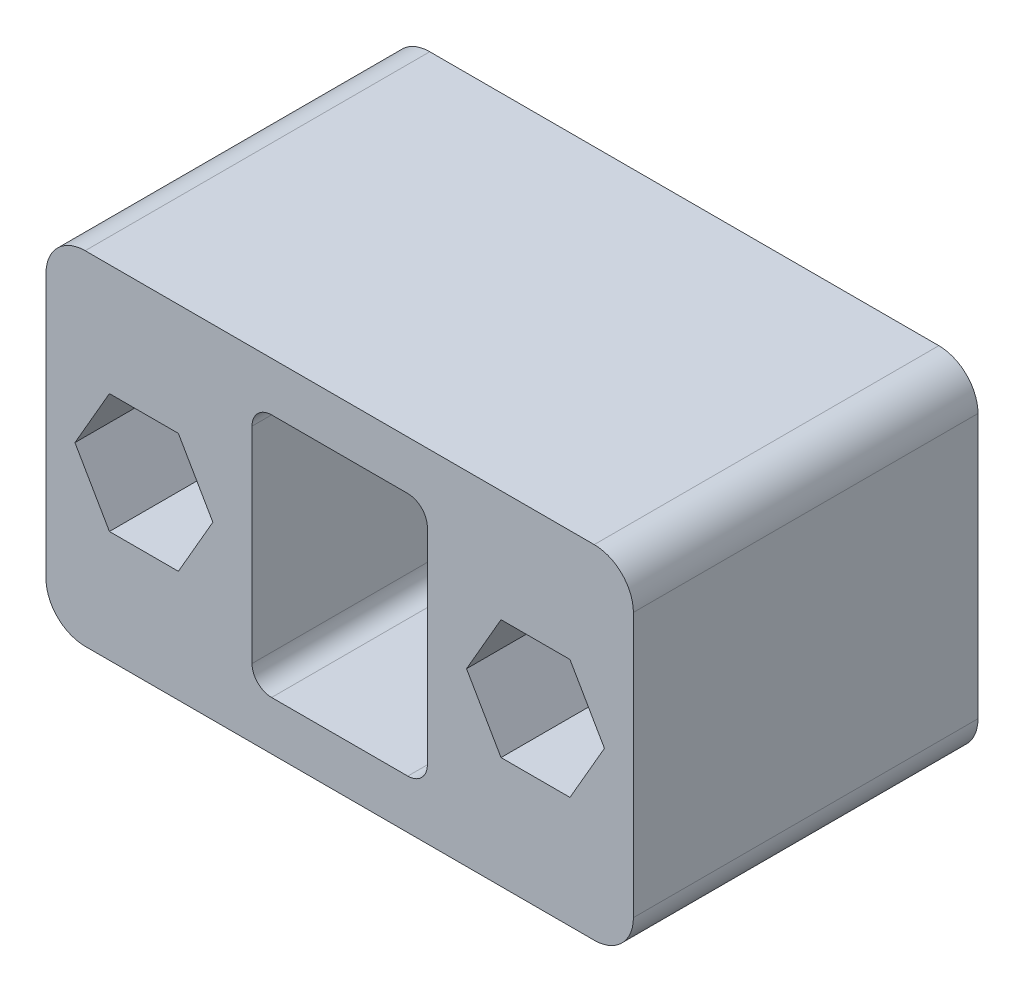
ISO-10303-21;
HEADER;
FILE_DESCRIPTION(('STEP AP214'),'2;1');
FILE_NAME('part.step','',(''),(''),'','','');
FILE_SCHEMA(('AUTOMOTIVE_DESIGN { 1 0 10303 214 1 1 1 1 }'));
ENDSEC;
DATA;
#1=APPLICATION_CONTEXT('core data for automotive mechanical design processes');
#2=APPLICATION_PROTOCOL_DEFINITION('international standard','automotive_design',2000,#1);
#3=PRODUCT_CONTEXT('',#1,'mechanical');
#4=PRODUCT('Part','Part','',(#3));
#5=PRODUCT_RELATED_PRODUCT_CATEGORY('part','',(#4));
#6=PRODUCT_DEFINITION_FORMATION('','',#4);
#7=PRODUCT_DEFINITION_CONTEXT('part definition',#1,'design');
#8=PRODUCT_DEFINITION('design','',#6,#7);
#9=PRODUCT_DEFINITION_SHAPE('','',#8);
#10=(LENGTH_UNIT() NAMED_UNIT(*) SI_UNIT(.MILLI.,.METRE.));
#11=(NAMED_UNIT(*) PLANE_ANGLE_UNIT() SI_UNIT($,.RADIAN.));
#12=(NAMED_UNIT(*) SI_UNIT($,.STERADIAN.) SOLID_ANGLE_UNIT());
#13=UNCERTAINTY_MEASURE_WITH_UNIT(LENGTH_MEASURE(1.E-05),#10,'distance_accuracy_value','');
#14=(GEOMETRIC_REPRESENTATION_CONTEXT(3) GLOBAL_UNCERTAINTY_ASSIGNED_CONTEXT((#13)) GLOBAL_UNIT_ASSIGNED_CONTEXT((#10,
#11,#12)) REPRESENTATION_CONTEXT('',''));
#15=CARTESIAN_POINT('',(0.,0.,0.));
#16=DIRECTION('',(0.,0.,1.));
#17=DIRECTION('',(1.,0.,0.));
#18=AXIS2_PLACEMENT_3D('',#15,#16,#17);
#19=CARTESIAN_POINT('',(-8.23908167897165,3.05000000000001,17.6));
#20=DIRECTION('',(0.,-1.,0.));
#21=DIRECTION('',(0.,0.,-1.));
#22=AXIS2_PLACEMENT_3D('',#19,#20,#21);
#23=PLANE('',#22);
#24=DIRECTION('',(0.,0.,-1.));
#25=VECTOR('',#24,1.);
#26=CARTESIAN_POINT('',(-11.7609183210284,3.05000000000001,17.6));
#27=LINE('',#26,#25);
#28=CARTESIAN_POINT('',(-11.7609183210284,3.05000000000001,17.6));
#29=VERTEX_POINT('',#28);
#30=CARTESIAN_POINT('',(-11.7609183210284,3.05000000000001,2.1));
#31=VERTEX_POINT('',#30);
#32=EDGE_CURVE('E241',#29,#31,#27,.T.);
#33=ORIENTED_EDGE('',*,*,#32,.T.);
#34=DIRECTION('',(1.,0.,0.));
#35=VECTOR('',#34,1.);
#36=CARTESIAN_POINT('',(-8.23908167897165,3.05000000000001,2.1));
#37=LINE('',#36,#35);
#38=CARTESIAN_POINT('',(-8.23908167897165,3.05000000000001,2.1));
#39=VERTEX_POINT('',#38);
#40=EDGE_CURVE('E227',#31,#39,#37,.T.);
#41=ORIENTED_EDGE('',*,*,#40,.T.);
#42=DIRECTION('',(0.,0.,-1.));
#43=VECTOR('',#42,1.);
#44=CARTESIAN_POINT('',(-8.23908167897165,3.05000000000001,17.6));
#45=LINE('',#44,#43);
#46=CARTESIAN_POINT('',(-8.23908167897165,3.05000000000001,17.6));
#47=VERTEX_POINT('',#46);
#48=EDGE_CURVE('E238',#47,#39,#45,.T.);
#49=ORIENTED_EDGE('',*,*,#48,.F.);
#50=DIRECTION('',(-1.,0.,0.));
#51=VECTOR('',#50,1.);
#52=CARTESIAN_POINT('',(-8.23908167897165,3.05000000000001,17.6));
#53=LINE('',#52,#51);
#54=EDGE_CURVE('E434',#47,#29,#53,.T.);
#55=ORIENTED_EDGE('',*,*,#54,.T.);
#56=EDGE_LOOP('',(#33,#41,#49,#55));
#57=FACE_BOUND('',#56,.T.);
#58=ADVANCED_FACE('F37',(#57),#23,.T.);
#59=CARTESIAN_POINT('',(-11.7609183210284,3.05000000000001,17.6));
#60=DIRECTION('',(0.866025403784439,-0.5,0.));
#61=DIRECTION('',(0.5,0.866025403784438,0.));
#62=AXIS2_PLACEMENT_3D('',#59,#60,#61);
#63=PLANE('',#62);
#64=DIRECTION('',(0.,0.,-1.));
#65=VECTOR('',#64,1.);
#66=CARTESIAN_POINT('',(-13.5218366420567,0.,17.6));
#67=LINE('',#66,#65);
#68=CARTESIAN_POINT('',(-13.5218366420567,0.,17.6));
#69=VERTEX_POINT('',#68);
#70=CARTESIAN_POINT('',(-13.5218366420567,0.,2.1));
#71=VERTEX_POINT('',#70);
#72=EDGE_CURVE('E261',#69,#71,#67,.T.);
#73=ORIENTED_EDGE('',*,*,#72,.T.);
#74=DIRECTION('',(0.5,0.866025403784438,0.));
#75=VECTOR('',#74,1.);
#76=CARTESIAN_POINT('',(-11.7609183210284,3.05000000000001,2.1));
#77=LINE('',#76,#75);
#78=EDGE_CURVE('E243',#71,#31,#77,.T.);
#79=ORIENTED_EDGE('',*,*,#78,.T.);
#80=ORIENTED_EDGE('',*,*,#32,.F.);
#81=DIRECTION('',(-0.5,-0.866025403784438,0.));
#82=VECTOR('',#81,1.);
#83=CARTESIAN_POINT('',(-11.7609183210284,3.05000000000001,17.6));
#84=LINE('',#83,#82);
#85=EDGE_CURVE('E446',#29,#69,#84,.T.);
#86=ORIENTED_EDGE('',*,*,#85,.T.);
#87=EDGE_LOOP('',(#73,#79,#80,#86));
#88=FACE_BOUND('',#87,.T.);
#89=ADVANCED_FACE('F462',(#88),#63,.T.);
#90=CARTESIAN_POINT('',(-13.5218366420567,0.,17.6));
#91=DIRECTION('',(0.866025403784438,0.5,0.));
#92=DIRECTION('',(-0.5,0.866025403784438,0.));
#93=AXIS2_PLACEMENT_3D('',#90,#91,#92);
#94=PLANE('',#93);
#95=DIRECTION('',(0.,0.,-1.));
#96=VECTOR('',#95,1.);
#97=CARTESIAN_POINT('',(-11.7609183210284,-3.04999999999999,17.6));
#98=LINE('',#97,#96);
#99=CARTESIAN_POINT('',(-11.7609183210284,-3.04999999999999,17.6));
#100=VERTEX_POINT('',#99);
#101=CARTESIAN_POINT('',(-11.7609183210284,-3.04999999999999,2.1));
#102=VERTEX_POINT('',#101);
#103=EDGE_CURVE('E258',#100,#102,#98,.T.);
#104=ORIENTED_EDGE('',*,*,#103,.T.);
#105=DIRECTION('',(-0.5,0.866025403784438,0.));
#106=VECTOR('',#105,1.);
#107=CARTESIAN_POINT('',(-13.5218366420567,0.,2.1));
#108=LINE('',#107,#106);
#109=EDGE_CURVE('E399',#102,#71,#108,.T.);
#110=ORIENTED_EDGE('',*,*,#109,.T.);
#111=ORIENTED_EDGE('',*,*,#72,.F.);
#112=DIRECTION('',(0.5,-0.866025403784438,0.));
#113=VECTOR('',#112,1.);
#114=CARTESIAN_POINT('',(-13.5218366420567,0.,17.6));
#115=LINE('',#114,#113);
#116=EDGE_CURVE('E448',#69,#100,#115,.T.);
#117=ORIENTED_EDGE('',*,*,#116,.T.);
#118=EDGE_LOOP('',(#104,#110,#111,#117));
#119=FACE_BOUND('',#118,.T.);
#120=ADVANCED_FACE('F465',(#119),#94,.T.);
#121=CARTESIAN_POINT('',(-11.7609183210284,-3.04999999999999,17.6));
#122=DIRECTION('',(0.,1.,0.));
#123=DIRECTION('',(0.,0.,1.));
#124=AXIS2_PLACEMENT_3D('',#121,#122,#123);
#125=PLANE('',#124);
#126=DIRECTION('',(0.,0.,-1.));
#127=VECTOR('',#126,1.);
#128=CARTESIAN_POINT('',(-8.23908167897165,-3.04999999999999,17.6));
#129=LINE('',#128,#127);
#130=CARTESIAN_POINT('',(-8.23908167897165,-3.04999999999999,17.6));
#131=VERTEX_POINT('',#130);
#132=CARTESIAN_POINT('',(-8.23908167897165,-3.04999999999999,2.1));
#133=VERTEX_POINT('',#132);
#134=EDGE_CURVE('E250',#131,#133,#129,.T.);
#135=ORIENTED_EDGE('',*,*,#134,.T.);
#136=DIRECTION('',(-1.,0.,0.));
#137=VECTOR('',#136,1.);
#138=CARTESIAN_POINT('',(-11.7609183210284,-3.04999999999999,2.1));
#139=LINE('',#138,#137);
#140=EDGE_CURVE('E396',#133,#102,#139,.T.);
#141=ORIENTED_EDGE('',*,*,#140,.T.);
#142=ORIENTED_EDGE('',*,*,#103,.F.);
#143=DIRECTION('',(1.,0.,0.));
#144=VECTOR('',#143,1.);
#145=CARTESIAN_POINT('',(-11.7609183210284,-3.04999999999999,17.6));
#146=LINE('',#145,#144);
#147=EDGE_CURVE('E450',#100,#131,#146,.T.);
#148=ORIENTED_EDGE('',*,*,#147,.T.);
#149=EDGE_LOOP('',(#135,#141,#142,#148));
#150=FACE_BOUND('',#149,.T.);
#151=ADVANCED_FACE('F468',(#150),#125,.T.);
#152=CARTESIAN_POINT('',(-8.23908167897165,-3.04999999999999,17.6));
#153=DIRECTION('',(-0.866025403784439,0.5,0.));
#154=DIRECTION('',(-0.5,-0.866025403784439,0.));
#155=AXIS2_PLACEMENT_3D('',#152,#153,#154);
#156=PLANE('',#155);
#157=DIRECTION('',(0.,0.,-1.));
#158=VECTOR('',#157,1.);
#159=CARTESIAN_POINT('',(-6.47816335794329,0.,17.6));
#160=LINE('',#159,#158);
#161=CARTESIAN_POINT('',(-6.47816335794329,0.,17.6));
#162=VERTEX_POINT('',#161);
#163=CARTESIAN_POINT('',(-6.47816335794329,0.,2.1));
#164=VERTEX_POINT('',#163);
#165=EDGE_CURVE('E248',#162,#164,#160,.T.);
#166=ORIENTED_EDGE('',*,*,#165,.T.);
#167=DIRECTION('',(-0.5,-0.866025403784439,0.));
#168=VECTOR('',#167,1.);
#169=CARTESIAN_POINT('',(-8.23908167897165,-3.04999999999999,2.1));
#170=LINE('',#169,#168);
#171=EDGE_CURVE('E230',#164,#133,#170,.T.);
#172=ORIENTED_EDGE('',*,*,#171,.T.);
#173=ORIENTED_EDGE('',*,*,#134,.F.);
#174=DIRECTION('',(0.5,0.866025403784439,0.));
#175=VECTOR('',#174,1.);
#176=CARTESIAN_POINT('',(-8.23908167897165,-3.04999999999999,17.6));
#177=LINE('',#176,#175);
#178=EDGE_CURVE('E252',#131,#162,#177,.T.);
#179=ORIENTED_EDGE('',*,*,#178,.T.);
#180=EDGE_LOOP('',(#166,#172,#173,#179));
#181=FACE_BOUND('',#180,.T.);
#182=ADVANCED_FACE('F455',(#181),#156,.T.);
#183=CARTESIAN_POINT('',(-6.47816335794329,0.,17.6));
#184=DIRECTION('',(-0.866025403784439,-0.5,0.));
#185=DIRECTION('',(0.5,-0.866025403784439,0.));
#186=AXIS2_PLACEMENT_3D('',#183,#184,#185);
#187=PLANE('',#186);
#188=ORIENTED_EDGE('',*,*,#48,.T.);
#189=DIRECTION('',(0.5,-0.866025403784439,0.));
#190=VECTOR('',#189,1.);
#191=CARTESIAN_POINT('',(-6.47816335794329,0.,2.1));
#192=LINE('',#191,#190);
#193=EDGE_CURVE('E224',#39,#164,#192,.T.);
#194=ORIENTED_EDGE('',*,*,#193,.T.);
#195=ORIENTED_EDGE('',*,*,#165,.F.);
#196=DIRECTION('',(-0.5,0.866025403784439,0.));
#197=VECTOR('',#196,1.);
#198=CARTESIAN_POINT('',(-6.47816335794329,0.,17.6));
#199=LINE('',#198,#197);
#200=EDGE_CURVE('E247',#162,#47,#199,.T.);
#201=ORIENTED_EDGE('',*,*,#200,.T.);
#202=EDGE_LOOP('',(#188,#194,#195,#201));
#203=FACE_BOUND('',#202,.T.);
#204=ADVANCED_FACE('F245',(#203),#187,.T.);
#205=CARTESIAN_POINT('',(13.5218366420567,0.,17.6));
#206=DIRECTION('',(-0.866025403784439,-0.5,0.));
#207=DIRECTION('',(0.5,-0.866025403784439,0.));
#208=AXIS2_PLACEMENT_3D('',#205,#206,#207);
#209=PLANE('',#208);
#210=DIRECTION('',(0.,0.,-1.));
#211=VECTOR('',#210,1.);
#212=CARTESIAN_POINT('',(11.7609183210284,3.05000000000001,17.6));
#213=LINE('',#212,#211);
#214=CARTESIAN_POINT('',(11.7609183210284,3.05000000000001,17.6));
#215=VERTEX_POINT('',#214);
#216=CARTESIAN_POINT('',(11.7609183210284,3.05000000000001,2.1));
#217=VERTEX_POINT('',#216);
#218=EDGE_CURVE('E293',#215,#217,#213,.T.);
#219=ORIENTED_EDGE('',*,*,#218,.T.);
#220=DIRECTION('',(0.5,-0.866025403784439,0.));
#221=VECTOR('',#220,1.);
#222=CARTESIAN_POINT('',(13.5218366420567,0.,2.1));
#223=LINE('',#222,#221);
#224=CARTESIAN_POINT('',(13.5218366420567,0.,2.1));
#225=VERTEX_POINT('',#224);
#226=EDGE_CURVE('E417',#217,#225,#223,.T.);
#227=ORIENTED_EDGE('',*,*,#226,.T.);
#228=DIRECTION('',(0.,0.,-1.));
#229=VECTOR('',#228,1.);
#230=CARTESIAN_POINT('',(13.5218366420567,0.,17.6));
#231=LINE('',#230,#229);
#232=CARTESIAN_POINT('',(13.5218366420567,0.,17.6));
#233=VERTEX_POINT('',#232);
#234=EDGE_CURVE('E278',#233,#225,#231,.T.);
#235=ORIENTED_EDGE('',*,*,#234,.F.);
#236=DIRECTION('',(-0.5,0.866025403784439,0.));
#237=VECTOR('',#236,1.);
#238=CARTESIAN_POINT('',(13.5218366420567,0.,17.6));
#239=LINE('',#238,#237);
#240=EDGE_CURVE('E265',#233,#215,#239,.T.);
#241=ORIENTED_EDGE('',*,*,#240,.T.);
#242=EDGE_LOOP('',(#219,#227,#235,#241));
#243=FACE_BOUND('',#242,.T.);
#244=ADVANCED_FACE('F503',(#243),#209,.T.);
#245=CARTESIAN_POINT('',(11.7609183210284,3.05000000000001,17.6));
#246=DIRECTION('',(0.,-1.,0.));
#247=DIRECTION('',(0.,0.,-1.));
#248=AXIS2_PLACEMENT_3D('',#245,#246,#247);
#249=PLANE('',#248);
#250=DIRECTION('',(0.,0.,-1.));
#251=VECTOR('',#250,1.);
#252=CARTESIAN_POINT('',(8.23908167897164,3.05000000000001,17.6));
#253=LINE('',#252,#251);
#254=CARTESIAN_POINT('',(8.23908167897164,3.05000000000001,17.6));
#255=VERTEX_POINT('',#254);
#256=CARTESIAN_POINT('',(8.23908167897164,3.05000000000001,2.1));
#257=VERTEX_POINT('',#256);
#258=EDGE_CURVE('E290',#255,#257,#253,.T.);
#259=ORIENTED_EDGE('',*,*,#258,.T.);
#260=DIRECTION('',(1.,0.,0.));
#261=VECTOR('',#260,1.);
#262=CARTESIAN_POINT('',(11.7609183210284,3.05000000000001,2.1));
#263=LINE('',#262,#261);
#264=EDGE_CURVE('E414',#257,#217,#263,.T.);
#265=ORIENTED_EDGE('',*,*,#264,.T.);
#266=ORIENTED_EDGE('',*,*,#218,.F.);
#267=DIRECTION('',(-1.,0.,0.));
#268=VECTOR('',#267,1.);
#269=CARTESIAN_POINT('',(11.7609183210284,3.05000000000001,17.6));
#270=LINE('',#269,#268);
#271=EDGE_CURVE('E267',#215,#255,#270,.T.);
#272=ORIENTED_EDGE('',*,*,#271,.T.);
#273=EDGE_LOOP('',(#259,#265,#266,#272));
#274=FACE_BOUND('',#273,.T.);
#275=ADVANCED_FACE('F499',(#274),#249,.T.);
#276=CARTESIAN_POINT('',(8.23908167897164,3.05000000000001,17.6));
#277=DIRECTION('',(0.866025403784439,-0.5,0.));
#278=DIRECTION('',(0.5,0.866025403784439,0.));
#279=AXIS2_PLACEMENT_3D('',#276,#277,#278);
#280=PLANE('',#279);
#281=DIRECTION('',(0.,0.,-1.));
#282=VECTOR('',#281,1.);
#283=CARTESIAN_POINT('',(6.47816335794328,0.,17.6));
#284=LINE('',#283,#282);
#285=CARTESIAN_POINT('',(6.47816335794328,0.,17.6));
#286=VERTEX_POINT('',#285);
#287=CARTESIAN_POINT('',(6.47816335794328,0.,2.1));
#288=VERTEX_POINT('',#287);
#289=EDGE_CURVE('E287',#286,#288,#284,.T.);
#290=ORIENTED_EDGE('',*,*,#289,.T.);
#291=DIRECTION('',(0.5,0.866025403784439,0.));
#292=VECTOR('',#291,1.);
#293=CARTESIAN_POINT('',(8.23908167897164,3.05000000000001,2.1));
#294=LINE('',#293,#292);
#295=EDGE_CURVE('E411',#288,#257,#294,.T.);
#296=ORIENTED_EDGE('',*,*,#295,.T.);
#297=ORIENTED_EDGE('',*,*,#258,.F.);
#298=DIRECTION('',(-0.5,-0.866025403784439,0.));
#299=VECTOR('',#298,1.);
#300=CARTESIAN_POINT('',(8.23908167897164,3.05000000000001,17.6));
#301=LINE('',#300,#299);
#302=EDGE_CURVE('E269',#255,#286,#301,.T.);
#303=ORIENTED_EDGE('',*,*,#302,.T.);
#304=EDGE_LOOP('',(#290,#296,#297,#303));
#305=FACE_BOUND('',#304,.T.);
#306=ADVANCED_FACE('F495',(#305),#280,.T.);
#307=CARTESIAN_POINT('',(6.47816335794328,0.,17.6));
#308=DIRECTION('',(0.866025403784439,0.499999999999999,0.));
#309=DIRECTION('',(-0.499999999999999,0.866025403784439,0.));
#310=AXIS2_PLACEMENT_3D('',#307,#308,#309);
#311=PLANE('',#310);
#312=DIRECTION('',(0.,0.,-1.));
#313=VECTOR('',#312,1.);
#314=CARTESIAN_POINT('',(8.23908167897164,-3.04999999999999,17.6));
#315=LINE('',#314,#313);
#316=CARTESIAN_POINT('',(8.23908167897164,-3.04999999999999,17.6));
#317=VERTEX_POINT('',#316);
#318=CARTESIAN_POINT('',(8.23908167897164,-3.04999999999999,2.1));
#319=VERTEX_POINT('',#318);
#320=EDGE_CURVE('E284',#317,#319,#315,.T.);
#321=ORIENTED_EDGE('',*,*,#320,.T.);
#322=DIRECTION('',(-0.499999999999999,0.866025403784439,0.));
#323=VECTOR('',#322,1.);
#324=CARTESIAN_POINT('',(6.47816335794328,0.,2.1));
#325=LINE('',#324,#323);
#326=EDGE_CURVE('E408',#319,#288,#325,.T.);
#327=ORIENTED_EDGE('',*,*,#326,.T.);
#328=ORIENTED_EDGE('',*,*,#289,.F.);
#329=DIRECTION('',(0.499999999999999,-0.866025403784439,0.));
#330=VECTOR('',#329,1.);
#331=CARTESIAN_POINT('',(6.47816335794328,0.,17.6));
#332=LINE('',#331,#330);
#333=EDGE_CURVE('E271',#286,#317,#332,.T.);
#334=ORIENTED_EDGE('',*,*,#333,.T.);
#335=EDGE_LOOP('',(#321,#327,#328,#334));
#336=FACE_BOUND('',#335,.T.);
#337=ADVANCED_FACE('F491',(#336),#311,.T.);
#338=CARTESIAN_POINT('',(8.23908167897164,-3.04999999999999,17.6));
#339=DIRECTION('',(0.,1.,0.));
#340=DIRECTION('',(0.,0.,1.));
#341=AXIS2_PLACEMENT_3D('',#338,#339,#340);
#342=PLANE('',#341);
#343=DIRECTION('',(0.,0.,-1.));
#344=VECTOR('',#343,1.);
#345=CARTESIAN_POINT('',(11.7609183210284,-3.04999999999999,17.6));
#346=LINE('',#345,#344);
#347=CARTESIAN_POINT('',(11.7609183210284,-3.04999999999999,17.6));
#348=VERTEX_POINT('',#347);
#349=CARTESIAN_POINT('',(11.7609183210284,-3.04999999999999,2.1));
#350=VERTEX_POINT('',#349);
#351=EDGE_CURVE('E281',#348,#350,#346,.T.);
#352=ORIENTED_EDGE('',*,*,#351,.T.);
#353=DIRECTION('',(-1.,0.,0.));
#354=VECTOR('',#353,1.);
#355=CARTESIAN_POINT('',(8.23908167897164,-3.04999999999999,2.1));
#356=LINE('',#355,#354);
#357=EDGE_CURVE('E405',#350,#319,#356,.T.);
#358=ORIENTED_EDGE('',*,*,#357,.T.);
#359=ORIENTED_EDGE('',*,*,#320,.F.);
#360=DIRECTION('',(1.,0.,0.));
#361=VECTOR('',#360,1.);
#362=CARTESIAN_POINT('',(8.23908167897164,-3.04999999999999,17.6));
#363=LINE('',#362,#361);
#364=EDGE_CURVE('E273',#317,#348,#363,.T.);
#365=ORIENTED_EDGE('',*,*,#364,.T.);
#366=EDGE_LOOP('',(#352,#358,#359,#365));
#367=FACE_BOUND('',#366,.T.);
#368=ADVANCED_FACE('F487',(#367),#342,.T.);
#369=CARTESIAN_POINT('',(11.7609183210284,-3.04999999999999,17.6));
#370=DIRECTION('',(-0.866025403784439,0.5,0.));
#371=DIRECTION('',(-0.5,-0.866025403784439,0.));
#372=AXIS2_PLACEMENT_3D('',#369,#370,#371);
#373=PLANE('',#372);
#374=ORIENTED_EDGE('',*,*,#234,.T.);
#375=DIRECTION('',(-0.5,-0.866025403784439,0.));
#376=VECTOR('',#375,1.);
#377=CARTESIAN_POINT('',(11.7609183210284,-3.04999999999999,2.1));
#378=LINE('',#377,#376);
#379=EDGE_CURVE('E242',#225,#350,#378,.T.);
#380=ORIENTED_EDGE('',*,*,#379,.T.);
#381=ORIENTED_EDGE('',*,*,#351,.F.);
#382=DIRECTION('',(0.5,0.866025403784439,0.));
#383=VECTOR('',#382,1.);
#384=CARTESIAN_POINT('',(11.7609183210284,-3.04999999999999,17.6));
#385=LINE('',#384,#383);
#386=EDGE_CURVE('E276',#348,#233,#385,.T.);
#387=ORIENTED_EDGE('',*,*,#386,.T.);
#388=EDGE_LOOP('',(#374,#380,#381,#387));
#389=FACE_BOUND('',#388,.T.);
#390=ADVANCED_FACE('F484',(#389),#373,.T.);
#391=CARTESIAN_POINT('',(0.,0.,17.6));
#392=DIRECTION('',(0.,0.,-1.));
#393=DIRECTION('',(-1.,0.,0.));
#394=AXIS2_PLACEMENT_3D('',#391,#392,#393);
#395=PLANE('',#394);
#396=ORIENTED_EDGE('',*,*,#54,.F.);
#397=ORIENTED_EDGE('',*,*,#200,.F.);
#398=ORIENTED_EDGE('',*,*,#178,.F.);
#399=ORIENTED_EDGE('',*,*,#147,.F.);
#400=ORIENTED_EDGE('',*,*,#116,.F.);
#401=ORIENTED_EDGE('',*,*,#85,.F.);
#402=EDGE_LOOP('',(#396,#397,#398,#399,#400,#401));
#403=FACE_BOUND('',#402,.T.);
#404=DIRECTION('',(1.,0.,0.));
#405=VECTOR('',#404,1.);
#406=CARTESIAN_POINT('',(-15.,-8.75,17.6));
#407=LINE('',#406,#405);
#408=CARTESIAN_POINT('',(-13.,-8.75,17.6));
#409=VERTEX_POINT('',#408);
#410=CARTESIAN_POINT('',(13.,-8.75,17.6));
#411=VERTEX_POINT('',#410);
#412=EDGE_CURVE('E305',#409,#411,#407,.T.);
#413=ORIENTED_EDGE('',*,*,#412,.T.);
#414=CARTESIAN_POINT('',(13.,-6.75,17.6));
#415=DIRECTION('',(0.,0.,-1.));
#416=DIRECTION('',(-1.,0.,0.));
#417=AXIS2_PLACEMENT_3D('',#414,#415,#416);
#418=CIRCLE('',#417,2.);
#419=CARTESIAN_POINT('',(15.,-6.75,17.6));
#420=VERTEX_POINT('',#419);
#421=EDGE_CURVE('E374',#411,#420,#418,.F.);
#422=ORIENTED_EDGE('',*,*,#421,.T.);
#423=DIRECTION('',(0.,1.,0.));
#424=VECTOR('',#423,1.);
#425=CARTESIAN_POINT('',(15.,-8.75,17.6));
#426=LINE('',#425,#424);
#427=CARTESIAN_POINT('',(15.,6.75,17.6));
#428=VERTEX_POINT('',#427);
#429=EDGE_CURVE('E297',#420,#428,#426,.T.);
#430=ORIENTED_EDGE('',*,*,#429,.T.);
#431=CARTESIAN_POINT('',(13.,6.75,17.6));
#432=DIRECTION('',(0.,0.,-1.));
#433=DIRECTION('',(-1.,0.,0.));
#434=AXIS2_PLACEMENT_3D('',#431,#432,#433);
#435=CIRCLE('',#434,2.);
#436=CARTESIAN_POINT('',(13.,8.75,17.6));
#437=VERTEX_POINT('',#436);
#438=EDGE_CURVE('E369',#428,#437,#435,.F.);
#439=ORIENTED_EDGE('',*,*,#438,.T.);
#440=DIRECTION('',(-1.,0.,0.));
#441=VECTOR('',#440,1.);
#442=CARTESIAN_POINT('',(-15.,8.75,17.6));
#443=LINE('',#442,#441);
#444=CARTESIAN_POINT('',(-13.,8.75,17.6));
#445=VERTEX_POINT('',#444);
#446=EDGE_CURVE('E300',#437,#445,#443,.T.);
#447=ORIENTED_EDGE('',*,*,#446,.T.);
#448=CARTESIAN_POINT('',(-13.,6.75,17.6));
#449=DIRECTION('',(0.,0.,-1.));
#450=DIRECTION('',(-1.,0.,0.));
#451=AXIS2_PLACEMENT_3D('',#448,#449,#450);
#452=CIRCLE('',#451,2.);
#453=CARTESIAN_POINT('',(-15.,6.75,17.6));
#454=VERTEX_POINT('',#453);
#455=EDGE_CURVE('E61',#445,#454,#452,.F.);
#456=ORIENTED_EDGE('',*,*,#455,.T.);
#457=DIRECTION('',(0.,-1.,0.));
#458=VECTOR('',#457,1.);
#459=CARTESIAN_POINT('',(-15.,-8.75,17.6));
#460=LINE('',#459,#458);
#461=CARTESIAN_POINT('',(-15.,-6.75,17.6));
#462=VERTEX_POINT('',#461);
#463=EDGE_CURVE('E303',#454,#462,#460,.T.);
#464=ORIENTED_EDGE('',*,*,#463,.T.);
#465=CARTESIAN_POINT('',(-13.,-6.75,17.6));
#466=DIRECTION('',(0.,0.,-1.));
#467=DIRECTION('',(-1.,0.,0.));
#468=AXIS2_PLACEMENT_3D('',#465,#466,#467);
#469=CIRCLE('',#468,2.);
#470=EDGE_CURVE('E372',#462,#409,#469,.F.);
#471=ORIENTED_EDGE('',*,*,#470,.T.);
#472=EDGE_LOOP('',(#413,#422,#430,#439,#447,#456,#464,#471));
#473=FACE_BOUND('',#472,.T.);
#474=ORIENTED_EDGE('',*,*,#240,.F.);
#475=ORIENTED_EDGE('',*,*,#386,.F.);
#476=ORIENTED_EDGE('',*,*,#364,.F.);
#477=ORIENTED_EDGE('',*,*,#333,.F.);
#478=ORIENTED_EDGE('',*,*,#302,.F.);
#479=ORIENTED_EDGE('',*,*,#271,.F.);
#480=EDGE_LOOP('',(#474,#475,#476,#477,#478,#479));
#481=FACE_BOUND('',#480,.T.);
#482=DIRECTION('',(0.,1.,0.));
#483=VECTOR('',#482,1.);
#484=CARTESIAN_POINT('',(4.47816335794328,-6.25,17.6));
#485=LINE('',#484,#483);
#486=CARTESIAN_POINT('',(4.47816335794328,-5.25,17.6));
#487=VERTEX_POINT('',#486);
#488=CARTESIAN_POINT('',(4.47816335794328,5.25,17.6));
#489=VERTEX_POINT('',#488);
#490=EDGE_CURVE('E421',#487,#489,#485,.T.);
#491=ORIENTED_EDGE('',*,*,#490,.F.);
#492=CARTESIAN_POINT('',(3.47816335794328,-5.25,17.6));
#493=DIRECTION('',(0.,0.,-1.));
#494=DIRECTION('',(-1.,0.,0.));
#495=AXIS2_PLACEMENT_3D('',#492,#493,#494);
#496=CIRCLE('',#495,1.);
#497=CARTESIAN_POINT('',(3.47816335794328,-6.25,17.6));
#498=VERTEX_POINT('',#497);
#499=EDGE_CURVE('E345',#487,#498,#496,.T.);
#500=ORIENTED_EDGE('',*,*,#499,.T.);
#501=DIRECTION('',(1.,0.,0.));
#502=VECTOR('',#501,1.);
#503=CARTESIAN_POINT('',(-4.47816335794328,-6.25,17.6));
#504=LINE('',#503,#502);
#505=CARTESIAN_POINT('',(-3.47816335794328,-6.25,17.6));
#506=VERTEX_POINT('',#505);
#507=EDGE_CURVE('E431',#506,#498,#504,.T.);
#508=ORIENTED_EDGE('',*,*,#507,.F.);
#509=CARTESIAN_POINT('',(-3.47816335794328,-5.25,17.6));
#510=DIRECTION('',(0.,0.,-1.));
#511=DIRECTION('',(-1.,0.,0.));
#512=AXIS2_PLACEMENT_3D('',#509,#510,#511);
#513=CIRCLE('',#512,1.);
#514=CARTESIAN_POINT('',(-4.47816335794328,-5.25,17.6));
#515=VERTEX_POINT('',#514);
#516=EDGE_CURVE('E341',#506,#515,#513,.T.);
#517=ORIENTED_EDGE('',*,*,#516,.T.);
#518=DIRECTION('',(0.,-1.,0.));
#519=VECTOR('',#518,1.);
#520=CARTESIAN_POINT('',(-4.47816335794328,-6.25,17.6));
#521=LINE('',#520,#519);
#522=CARTESIAN_POINT('',(-4.47816335794328,5.25,17.6));
#523=VERTEX_POINT('',#522);
#524=EDGE_CURVE('E428',#523,#515,#521,.T.);
#525=ORIENTED_EDGE('',*,*,#524,.F.);
#526=CARTESIAN_POINT('',(-3.47816335794328,5.25,17.6));
#527=DIRECTION('',(0.,0.,-1.));
#528=DIRECTION('',(-1.,0.,0.));
#529=AXIS2_PLACEMENT_3D('',#526,#527,#528);
#530=CIRCLE('',#529,1.);
#531=CARTESIAN_POINT('',(-3.47816335794328,6.25,17.6));
#532=VERTEX_POINT('',#531);
#533=EDGE_CURVE('E349',#523,#532,#530,.T.);
#534=ORIENTED_EDGE('',*,*,#533,.T.);
#535=DIRECTION('',(-1.,0.,0.));
#536=VECTOR('',#535,1.);
#537=CARTESIAN_POINT('',(-4.47816335794328,6.25,17.6));
#538=LINE('',#537,#536);
#539=CARTESIAN_POINT('',(3.47816335794328,6.25,17.6));
#540=VERTEX_POINT('',#539);
#541=EDGE_CURVE('E424',#540,#532,#538,.T.);
#542=ORIENTED_EDGE('',*,*,#541,.F.);
#543=CARTESIAN_POINT('',(3.47816335794328,5.25,17.6));
#544=DIRECTION('',(0.,0.,-1.));
#545=DIRECTION('',(-1.,0.,0.));
#546=AXIS2_PLACEMENT_3D('',#543,#544,#545);
#547=CIRCLE('',#546,1.);
#548=EDGE_CURVE('E337',#540,#489,#547,.T.);
#549=ORIENTED_EDGE('',*,*,#548,.T.);
#550=EDGE_LOOP('',(#491,#500,#508,#517,#525,#534,#542,#549));
#551=FACE_BOUND('',#550,.T.);
#552=ADVANCED_FACE('F458',(#403,#473,#481,#551),#395,.F.);
#553=CARTESIAN_POINT('',(0.,0.,0.));
#554=DIRECTION('',(0.,0.,-1.));
#555=DIRECTION('',(-1.,0.,0.));
#556=AXIS2_PLACEMENT_3D('',#553,#554,#555);
#557=PLANE('',#556);
#558=CARTESIAN_POINT('',(10.,0.,0.));
#559=DIRECTION('',(0.,0.,-1.));
#560=DIRECTION('',(-1.,0.,0.));
#561=AXIS2_PLACEMENT_3D('',#558,#559,#560);
#562=CIRCLE('',#561,2.1);
#563=CARTESIAN_POINT('',(7.9,0.,0.));
#564=VERTEX_POINT('',#563);
#565=EDGE_CURVE('E41',#564,#564,#562,.T.);
#566=ORIENTED_EDGE('',*,*,#565,.F.);
#567=EDGE_LOOP('',(#566));
#568=FACE_BOUND('',#567,.T.);
#569=CARTESIAN_POINT('',(-10.,0.,0.));
#570=DIRECTION('',(0.,0.,-1.));
#571=DIRECTION('',(-1.,0.,0.));
#572=AXIS2_PLACEMENT_3D('',#569,#570,#571);
#573=CIRCLE('',#572,2.1);
#574=CARTESIAN_POINT('',(-12.1,0.,0.));
#575=VERTEX_POINT('',#574);
#576=EDGE_CURVE('E381',#575,#575,#573,.T.);
#577=ORIENTED_EDGE('',*,*,#576,.F.);
#578=EDGE_LOOP('',(#577));
#579=FACE_BOUND('',#578,.T.);
#580=CARTESIAN_POINT('',(-3.47816335794328,5.25,0.));
#581=DIRECTION('',(0.,0.,-1.));
#582=DIRECTION('',(-1.,0.,0.));
#583=AXIS2_PLACEMENT_3D('',#580,#581,#582);
#584=CIRCLE('',#583,1.);
#585=CARTESIAN_POINT('',(-3.47816335794328,6.25,0.));
#586=VERTEX_POINT('',#585);
#587=CARTESIAN_POINT('',(-4.47816335794328,5.25,0.));
#588=VERTEX_POINT('',#587);
#589=EDGE_CURVE('E347',#586,#588,#584,.F.);
#590=ORIENTED_EDGE('',*,*,#589,.T.);
#591=DIRECTION('',(0.,-1.,0.));
#592=VECTOR('',#591,1.);
#593=CARTESIAN_POINT('',(-4.47816335794328,-6.25,0.));
#594=LINE('',#593,#592);
#595=CARTESIAN_POINT('',(-4.47816335794328,-5.25,0.));
#596=VERTEX_POINT('',#595);
#597=EDGE_CURVE('E440',#588,#596,#594,.T.);
#598=ORIENTED_EDGE('',*,*,#597,.T.);
#599=CARTESIAN_POINT('',(-3.47816335794328,-5.25,0.));
#600=DIRECTION('',(0.,0.,-1.));
#601=DIRECTION('',(-1.,0.,0.));
#602=AXIS2_PLACEMENT_3D('',#599,#600,#601);
#603=CIRCLE('',#602,1.);
#604=CARTESIAN_POINT('',(-3.47816335794328,-6.25,0.));
#605=VERTEX_POINT('',#604);
#606=EDGE_CURVE('E339',#596,#605,#603,.F.);
#607=ORIENTED_EDGE('',*,*,#606,.T.);
#608=DIRECTION('',(1.,0.,0.));
#609=VECTOR('',#608,1.);
#610=CARTESIAN_POINT('',(-4.47816335794328,-6.25,0.));
#611=LINE('',#610,#609);
#612=CARTESIAN_POINT('',(3.47816335794328,-6.25,0.));
#613=VERTEX_POINT('',#612);
#614=EDGE_CURVE('E425',#605,#613,#611,.T.);
#615=ORIENTED_EDGE('',*,*,#614,.T.);
#616=CARTESIAN_POINT('',(3.47816335794328,-5.25,0.));
#617=DIRECTION('',(0.,0.,-1.));
#618=DIRECTION('',(-1.,0.,0.));
#619=AXIS2_PLACEMENT_3D('',#616,#617,#618);
#620=CIRCLE('',#619,1.);
#621=CARTESIAN_POINT('',(4.47816335794328,-5.25,0.));
#622=VERTEX_POINT('',#621);
#623=EDGE_CURVE('E343',#613,#622,#620,.F.);
#624=ORIENTED_EDGE('',*,*,#623,.T.);
#625=DIRECTION('',(0.,1.,0.));
#626=VECTOR('',#625,1.);
#627=CARTESIAN_POINT('',(4.47816335794328,-6.25,0.));
#628=LINE('',#627,#626);
#629=CARTESIAN_POINT('',(4.47816335794328,5.25,0.));
#630=VERTEX_POINT('',#629);
#631=EDGE_CURVE('E420',#622,#630,#628,.T.);
#632=ORIENTED_EDGE('',*,*,#631,.T.);
#633=CARTESIAN_POINT('',(3.47816335794328,5.25,0.));
#634=DIRECTION('',(0.,0.,-1.));
#635=DIRECTION('',(-1.,0.,0.));
#636=AXIS2_PLACEMENT_3D('',#633,#634,#635);
#637=CIRCLE('',#636,1.);
#638=CARTESIAN_POINT('',(3.47816335794328,6.25,0.));
#639=VERTEX_POINT('',#638);
#640=EDGE_CURVE('E335',#630,#639,#637,.F.);
#641=ORIENTED_EDGE('',*,*,#640,.T.);
#642=DIRECTION('',(-1.,0.,0.));
#643=VECTOR('',#642,1.);
#644=CARTESIAN_POINT('',(-4.47816335794328,6.25,0.));
#645=LINE('',#644,#643);
#646=EDGE_CURVE('E437',#639,#586,#645,.T.);
#647=ORIENTED_EDGE('',*,*,#646,.T.);
#648=EDGE_LOOP('',(#590,#598,#607,#615,#624,#632,#641,#647));
#649=FACE_BOUND('',#648,.T.);
#650=DIRECTION('',(0.,1.,0.));
#651=VECTOR('',#650,1.);
#652=CARTESIAN_POINT('',(15.,-8.75,0.));
#653=LINE('',#652,#651);
#654=CARTESIAN_POINT('',(15.,-6.75,0.));
#655=VERTEX_POINT('',#654);
#656=CARTESIAN_POINT('',(15.,6.75,0.));
#657=VERTEX_POINT('',#656);
#658=EDGE_CURVE('E296',#655,#657,#653,.T.);
#659=ORIENTED_EDGE('',*,*,#658,.F.);
#660=CARTESIAN_POINT('',(13.,-6.75,0.));
#661=DIRECTION('',(0.,0.,-1.));
#662=DIRECTION('',(-1.,0.,0.));
#663=AXIS2_PLACEMENT_3D('',#660,#661,#662);
#664=CIRCLE('',#663,2.);
#665=CARTESIAN_POINT('',(13.,-8.75,0.));
#666=VERTEX_POINT('',#665);
#667=EDGE_CURVE('E362',#655,#666,#664,.T.);
#668=ORIENTED_EDGE('',*,*,#667,.T.);
#669=DIRECTION('',(1.,0.,0.));
#670=VECTOR('',#669,1.);
#671=CARTESIAN_POINT('',(-15.,-8.75,0.));
#672=LINE('',#671,#670);
#673=CARTESIAN_POINT('',(-13.,-8.75,0.));
#674=VERTEX_POINT('',#673);
#675=EDGE_CURVE('E301',#674,#666,#672,.T.);
#676=ORIENTED_EDGE('',*,*,#675,.F.);
#677=CARTESIAN_POINT('',(-13.,-6.75,0.));
#678=DIRECTION('',(0.,0.,-1.));
#679=DIRECTION('',(-1.,0.,0.));
#680=AXIS2_PLACEMENT_3D('',#677,#678,#679);
#681=CIRCLE('',#680,2.);
#682=CARTESIAN_POINT('',(-15.,-6.75,0.));
#683=VERTEX_POINT('',#682);
#684=EDGE_CURVE('E360',#674,#683,#681,.T.);
#685=ORIENTED_EDGE('',*,*,#684,.T.);
#686=DIRECTION('',(0.,-1.,0.));
#687=VECTOR('',#686,1.);
#688=CARTESIAN_POINT('',(-15.,-8.75,0.));
#689=LINE('',#688,#687);
#690=CARTESIAN_POINT('',(-15.,6.75,0.));
#691=VERTEX_POINT('',#690);
#692=EDGE_CURVE('E314',#691,#683,#689,.T.);
#693=ORIENTED_EDGE('',*,*,#692,.F.);
#694=CARTESIAN_POINT('',(-13.,6.75,0.));
#695=DIRECTION('',(0.,0.,-1.));
#696=DIRECTION('',(-1.,0.,0.));
#697=AXIS2_PLACEMENT_3D('',#694,#695,#696);
#698=CIRCLE('',#697,2.);
#699=CARTESIAN_POINT('',(-13.,8.75,0.));
#700=VERTEX_POINT('',#699);
#701=EDGE_CURVE('E358',#691,#700,#698,.T.);
#702=ORIENTED_EDGE('',*,*,#701,.T.);
#703=DIRECTION('',(-1.,0.,0.));
#704=VECTOR('',#703,1.);
#705=CARTESIAN_POINT('',(-15.,8.75,0.));
#706=LINE('',#705,#704);
#707=CARTESIAN_POINT('',(13.,8.75,0.));
#708=VERTEX_POINT('',#707);
#709=EDGE_CURVE('E311',#708,#700,#706,.T.);
#710=ORIENTED_EDGE('',*,*,#709,.F.);
#711=CARTESIAN_POINT('',(13.,6.75,0.));
#712=DIRECTION('',(0.,0.,-1.));
#713=DIRECTION('',(-1.,0.,0.));
#714=AXIS2_PLACEMENT_3D('',#711,#712,#713);
#715=CIRCLE('',#714,2.);
#716=EDGE_CURVE('E356',#708,#657,#715,.T.);
#717=ORIENTED_EDGE('',*,*,#716,.T.);
#718=EDGE_LOOP('',(#659,#668,#676,#685,#693,#702,#710,#717));
#719=FACE_BOUND('',#718,.T.);
#720=ADVANCED_FACE('F510',(#568,#579,#649,#719),#557,.T.);
#721=CARTESIAN_POINT('',(15.,-8.75,17.6));
#722=DIRECTION('',(-1.,0.,0.));
#723=DIRECTION('',(0.,0.,1.));
#724=AXIS2_PLACEMENT_3D('',#721,#722,#723);
#725=PLANE('',#724);
#726=ORIENTED_EDGE('',*,*,#429,.F.);
#727=DIRECTION('',(0.,0.,-1.));
#728=VECTOR('',#727,1.);
#729=CARTESIAN_POINT('',(15.,-6.75,17.6));
#730=LINE('',#729,#728);
#731=EDGE_CURVE('E353',#420,#655,#730,.T.);
#732=ORIENTED_EDGE('',*,*,#731,.T.);
#733=ORIENTED_EDGE('',*,*,#658,.T.);
#734=DIRECTION('',(0.,0.,-1.));
#735=VECTOR('',#734,1.);
#736=CARTESIAN_POINT('',(15.,6.75,17.6));
#737=LINE('',#736,#735);
#738=EDGE_CURVE('E351',#657,#428,#737,.F.);
#739=ORIENTED_EDGE('',*,*,#738,.T.);
#740=EDGE_LOOP('',(#726,#732,#733,#739));
#741=FACE_BOUND('',#740,.T.);
#742=ADVANCED_FACE('F513',(#741),#725,.F.);
#743=CARTESIAN_POINT('',(-15.,8.75,17.6));
#744=DIRECTION('',(0.,-1.,0.));
#745=DIRECTION('',(0.,0.,-1.));
#746=AXIS2_PLACEMENT_3D('',#743,#744,#745);
#747=PLANE('',#746);
#748=ORIENTED_EDGE('',*,*,#709,.T.);
#749=DIRECTION('',(0.,0.,-1.));
#750=VECTOR('',#749,1.);
#751=CARTESIAN_POINT('',(-13.,8.75,17.6));
#752=LINE('',#751,#750);
#753=EDGE_CURVE('E12',#700,#445,#752,.F.);
#754=ORIENTED_EDGE('',*,*,#753,.T.);
#755=ORIENTED_EDGE('',*,*,#446,.F.);
#756=DIRECTION('',(0.,0.,-1.));
#757=VECTOR('',#756,1.);
#758=CARTESIAN_POINT('',(13.,8.75,17.6));
#759=LINE('',#758,#757);
#760=EDGE_CURVE('E46',#437,#708,#759,.T.);
#761=ORIENTED_EDGE('',*,*,#760,.T.);
#762=EDGE_LOOP('',(#748,#754,#755,#761));
#763=FACE_BOUND('',#762,.T.);
#764=ADVANCED_FACE('F523',(#763),#747,.F.);
#765=CARTESIAN_POINT('',(-15.,-8.75,17.6));
#766=DIRECTION('',(1.,0.,0.));
#767=DIRECTION('',(0.,1.,0.));
#768=AXIS2_PLACEMENT_3D('',#765,#766,#767);
#769=PLANE('',#768);
#770=ORIENTED_EDGE('',*,*,#692,.T.);
#771=DIRECTION('',(0.,0.,-1.));
#772=VECTOR('',#771,1.);
#773=CARTESIAN_POINT('',(-15.,-6.75,17.6));
#774=LINE('',#773,#772);
#775=EDGE_CURVE('E54',#683,#462,#774,.F.);
#776=ORIENTED_EDGE('',*,*,#775,.T.);
#777=ORIENTED_EDGE('',*,*,#463,.F.);
#778=DIRECTION('',(0.,0.,-1.));
#779=VECTOR('',#778,1.);
#780=CARTESIAN_POINT('',(-15.,6.75,17.6));
#781=LINE('',#780,#779);
#782=EDGE_CURVE('E376',#454,#691,#781,.T.);
#783=ORIENTED_EDGE('',*,*,#782,.T.);
#784=EDGE_LOOP('',(#770,#776,#777,#783));
#785=FACE_BOUND('',#784,.T.);
#786=ADVANCED_FACE('F519',(#785),#769,.F.);
#787=CARTESIAN_POINT('',(-15.,-8.75,17.6));
#788=DIRECTION('',(0.,1.,0.));
#789=DIRECTION('',(0.,0.,1.));
#790=AXIS2_PLACEMENT_3D('',#787,#788,#789);
#791=PLANE('',#790);
#792=ORIENTED_EDGE('',*,*,#675,.T.);
#793=DIRECTION('',(0.,0.,-1.));
#794=VECTOR('',#793,1.);
#795=CARTESIAN_POINT('',(13.,-8.75,17.6));
#796=LINE('',#795,#794);
#797=EDGE_CURVE('E367',#666,#411,#796,.F.);
#798=ORIENTED_EDGE('',*,*,#797,.T.);
#799=ORIENTED_EDGE('',*,*,#412,.F.);
#800=DIRECTION('',(0.,0.,-1.));
#801=VECTOR('',#800,1.);
#802=CARTESIAN_POINT('',(-13.,-8.75,17.6));
#803=LINE('',#802,#801);
#804=EDGE_CURVE('E364',#409,#674,#803,.T.);
#805=ORIENTED_EDGE('',*,*,#804,.T.);
#806=EDGE_LOOP('',(#792,#798,#799,#805));
#807=FACE_BOUND('',#806,.T.);
#808=ADVANCED_FACE('F515',(#807),#791,.F.);
#809=CARTESIAN_POINT('',(4.47816335794328,-6.25,17.6));
#810=DIRECTION('',(-1.,0.,0.));
#811=DIRECTION('',(0.,0.,1.));
#812=AXIS2_PLACEMENT_3D('',#809,#810,#811);
#813=PLANE('',#812);
#814=DIRECTION('',(0.,0.,-1.));
#815=VECTOR('',#814,1.);
#816=CARTESIAN_POINT('',(4.47816335794328,-5.25,17.6));
#817=LINE('',#816,#815);
#818=EDGE_CURVE('E308',#622,#487,#817,.F.);
#819=ORIENTED_EDGE('',*,*,#818,.T.);
#820=ORIENTED_EDGE('',*,*,#490,.T.);
#821=DIRECTION('',(0.,0.,-1.));
#822=VECTOR('',#821,1.);
#823=CARTESIAN_POINT('',(4.47816335794328,5.25,0.));
#824=LINE('',#823,#822);
#825=EDGE_CURVE('E319',#489,#630,#824,.T.);
#826=ORIENTED_EDGE('',*,*,#825,.T.);
#827=ORIENTED_EDGE('',*,*,#631,.F.);
#828=EDGE_LOOP('',(#819,#820,#826,#827));
#829=FACE_BOUND('',#828,.T.);
#830=ADVANCED_FACE('F518',(#829),#813,.T.);
#831=CARTESIAN_POINT('',(-4.47816335794328,6.25,17.6));
#832=DIRECTION('',(0.,-1.,0.));
#833=DIRECTION('',(0.,0.,-1.));
#834=AXIS2_PLACEMENT_3D('',#831,#832,#833);
#835=PLANE('',#834);
#836=ORIENTED_EDGE('',*,*,#646,.F.);
#837=DIRECTION('',(0.,0.,-1.));
#838=VECTOR('',#837,1.);
#839=CARTESIAN_POINT('',(3.47816335794328,6.25,17.6));
#840=LINE('',#839,#838);
#841=EDGE_CURVE('E324',#639,#540,#840,.F.);
#842=ORIENTED_EDGE('',*,*,#841,.T.);
#843=ORIENTED_EDGE('',*,*,#541,.T.);
#844=DIRECTION('',(0.,0.,-1.));
#845=VECTOR('',#844,1.);
#846=CARTESIAN_POINT('',(-3.47816335794328,6.25,0.));
#847=LINE('',#846,#845);
#848=EDGE_CURVE('E321',#532,#586,#847,.T.);
#849=ORIENTED_EDGE('',*,*,#848,.T.);
#850=EDGE_LOOP('',(#836,#842,#843,#849));
#851=FACE_BOUND('',#850,.T.);
#852=ADVANCED_FACE('F612',(#851),#835,.T.);
#853=CARTESIAN_POINT('',(-4.47816335794328,-6.25,17.6));
#854=DIRECTION('',(1.,0.,0.));
#855=DIRECTION('',(0.,0.,-1.));
#856=AXIS2_PLACEMENT_3D('',#853,#854,#855);
#857=PLANE('',#856);
#858=DIRECTION('',(0.,0.,-1.));
#859=VECTOR('',#858,1.);
#860=CARTESIAN_POINT('',(-4.47816335794328,5.25,17.6));
#861=LINE('',#860,#859);
#862=EDGE_CURVE('E326',#588,#523,#861,.F.);
#863=ORIENTED_EDGE('',*,*,#862,.T.);
#864=ORIENTED_EDGE('',*,*,#524,.T.);
#865=DIRECTION('',(0.,0.,-1.));
#866=VECTOR('',#865,1.);
#867=CARTESIAN_POINT('',(-4.47816335794328,-5.25,0.));
#868=LINE('',#867,#866);
#869=EDGE_CURVE('E328',#515,#596,#868,.T.);
#870=ORIENTED_EDGE('',*,*,#869,.T.);
#871=ORIENTED_EDGE('',*,*,#597,.F.);
#872=EDGE_LOOP('',(#863,#864,#870,#871));
#873=FACE_BOUND('',#872,.T.);
#874=ADVANCED_FACE('F607',(#873),#857,.T.);
#875=CARTESIAN_POINT('',(-4.47816335794328,-6.25,17.6));
#876=DIRECTION('',(0.,1.,0.));
#877=DIRECTION('',(0.,0.,1.));
#878=AXIS2_PLACEMENT_3D('',#875,#876,#877);
#879=PLANE('',#878);
#880=ORIENTED_EDGE('',*,*,#614,.F.);
#881=DIRECTION('',(0.,0.,-1.));
#882=VECTOR('',#881,1.);
#883=CARTESIAN_POINT('',(-3.47816335794328,-6.25,17.6));
#884=LINE('',#883,#882);
#885=EDGE_CURVE('E333',#605,#506,#884,.F.);
#886=ORIENTED_EDGE('',*,*,#885,.T.);
#887=ORIENTED_EDGE('',*,*,#507,.T.);
#888=DIRECTION('',(0.,0.,-1.));
#889=VECTOR('',#888,1.);
#890=CARTESIAN_POINT('',(3.47816335794328,-6.25,0.));
#891=LINE('',#890,#889);
#892=EDGE_CURVE('E330',#498,#613,#891,.T.);
#893=ORIENTED_EDGE('',*,*,#892,.T.);
#894=EDGE_LOOP('',(#880,#886,#887,#893));
#895=FACE_BOUND('',#894,.T.);
#896=ADVANCED_FACE('F534',(#895),#879,.T.);
#897=CARTESIAN_POINT('',(3.47816335794328,5.25,17.6));
#898=DIRECTION('',(0.,0.,1.));
#899=DIRECTION('',(1.,0.,0.));
#900=AXIS2_PLACEMENT_3D('',#897,#898,#899);
#901=CYLINDRICAL_SURFACE('',#900,1.);
#902=ORIENTED_EDGE('',*,*,#548,.F.);
#903=ORIENTED_EDGE('',*,*,#841,.F.);
#904=ORIENTED_EDGE('',*,*,#640,.F.);
#905=ORIENTED_EDGE('',*,*,#825,.F.);
#906=EDGE_LOOP('',(#902,#903,#904,#905));
#907=FACE_BOUND('',#906,.T.);
#908=ADVANCED_FACE('F530',(#907),#901,.F.);
#909=CARTESIAN_POINT('',(-3.47816335794328,-5.25,17.6));
#910=DIRECTION('',(0.,0.,1.));
#911=DIRECTION('',(1.,0.,0.));
#912=AXIS2_PLACEMENT_3D('',#909,#910,#911);
#913=CYLINDRICAL_SURFACE('',#912,1.);
#914=ORIENTED_EDGE('',*,*,#516,.F.);
#915=ORIENTED_EDGE('',*,*,#885,.F.);
#916=ORIENTED_EDGE('',*,*,#606,.F.);
#917=ORIENTED_EDGE('',*,*,#869,.F.);
#918=EDGE_LOOP('',(#914,#915,#916,#917));
#919=FACE_BOUND('',#918,.T.);
#920=ADVANCED_FACE('F533',(#919),#913,.F.);
#921=CARTESIAN_POINT('',(3.47816335794328,-5.25,17.6));
#922=DIRECTION('',(0.,0.,1.));
#923=DIRECTION('',(1.,0.,0.));
#924=AXIS2_PLACEMENT_3D('',#921,#922,#923);
#925=CYLINDRICAL_SURFACE('',#924,1.);
#926=ORIENTED_EDGE('',*,*,#499,.F.);
#927=ORIENTED_EDGE('',*,*,#818,.F.);
#928=ORIENTED_EDGE('',*,*,#623,.F.);
#929=ORIENTED_EDGE('',*,*,#892,.F.);
#930=EDGE_LOOP('',(#926,#927,#928,#929));
#931=FACE_BOUND('',#930,.T.);
#932=ADVANCED_FACE('F538',(#931),#925,.F.);
#933=CARTESIAN_POINT('',(-3.47816335794328,5.25,17.6));
#934=DIRECTION('',(0.,0.,1.));
#935=DIRECTION('',(1.,0.,0.));
#936=AXIS2_PLACEMENT_3D('',#933,#934,#935);
#937=CYLINDRICAL_SURFACE('',#936,1.);
#938=ORIENTED_EDGE('',*,*,#533,.F.);
#939=ORIENTED_EDGE('',*,*,#862,.F.);
#940=ORIENTED_EDGE('',*,*,#589,.F.);
#941=ORIENTED_EDGE('',*,*,#848,.F.);
#942=EDGE_LOOP('',(#938,#939,#940,#941));
#943=FACE_BOUND('',#942,.T.);
#944=ADVANCED_FACE('F542',(#943),#937,.F.);
#945=CARTESIAN_POINT('',(0.,0.,2.1));
#946=DIRECTION('',(0.,0.,-1.));
#947=DIRECTION('',(-1.,0.,0.));
#948=AXIS2_PLACEMENT_3D('',#945,#946,#947);
#949=PLANE('',#948);
#950=CARTESIAN_POINT('',(10.,0.,2.1));
#951=DIRECTION('',(0.,0.,1.));
#952=DIRECTION('',(1.,0.,0.));
#953=AXIS2_PLACEMENT_3D('',#950,#951,#952);
#954=CIRCLE('',#953,2.1);
#955=CARTESIAN_POINT('',(12.1,0.,2.1));
#956=VERTEX_POINT('',#955);
#957=EDGE_CURVE('E383',#956,#956,#954,.T.);
#958=ORIENTED_EDGE('',*,*,#957,.F.);
#959=EDGE_LOOP('',(#958));
#960=FACE_BOUND('',#959,.T.);
#961=ORIENTED_EDGE('',*,*,#226,.F.);
#962=ORIENTED_EDGE('',*,*,#264,.F.);
#963=ORIENTED_EDGE('',*,*,#295,.F.);
#964=ORIENTED_EDGE('',*,*,#326,.F.);
#965=ORIENTED_EDGE('',*,*,#357,.F.);
#966=ORIENTED_EDGE('',*,*,#379,.F.);
#967=EDGE_LOOP('',(#961,#962,#963,#964,#965,#966));
#968=FACE_BOUND('',#967,.T.);
#969=ADVANCED_FACE('F546',(#960,#968),#949,.F.);
#970=CARTESIAN_POINT('',(0.,0.,2.1));
#971=DIRECTION('',(0.,0.,-1.));
#972=DIRECTION('',(-1.,0.,0.));
#973=AXIS2_PLACEMENT_3D('',#970,#971,#972);
#974=PLANE('',#973);
#975=CARTESIAN_POINT('',(-10.,0.,2.1));
#976=DIRECTION('',(0.,0.,1.));
#977=DIRECTION('',(1.,0.,0.));
#978=AXIS2_PLACEMENT_3D('',#975,#976,#977);
#979=CIRCLE('',#978,2.1);
#980=CARTESIAN_POINT('',(-7.9,0.,2.1));
#981=VERTEX_POINT('',#980);
#982=EDGE_CURVE('E388',#981,#981,#979,.T.);
#983=ORIENTED_EDGE('',*,*,#982,.F.);
#984=EDGE_LOOP('',(#983));
#985=FACE_BOUND('',#984,.T.);
#986=ORIENTED_EDGE('',*,*,#40,.F.);
#987=ORIENTED_EDGE('',*,*,#78,.F.);
#988=ORIENTED_EDGE('',*,*,#109,.F.);
#989=ORIENTED_EDGE('',*,*,#140,.F.);
#990=ORIENTED_EDGE('',*,*,#171,.F.);
#991=ORIENTED_EDGE('',*,*,#193,.F.);
#992=EDGE_LOOP('',(#986,#987,#988,#989,#990,#991));
#993=FACE_BOUND('',#992,.T.);
#994=ADVANCED_FACE('F226',(#985,#993),#974,.F.);
#995=CARTESIAN_POINT('',(13.,-6.75,17.6));
#996=DIRECTION('',(0.,0.,-1.));
#997=DIRECTION('',(-1.,0.,0.));
#998=AXIS2_PLACEMENT_3D('',#995,#996,#997);
#999=CYLINDRICAL_SURFACE('',#998,2.);
#1000=ORIENTED_EDGE('',*,*,#421,.F.);
#1001=ORIENTED_EDGE('',*,*,#797,.F.);
#1002=ORIENTED_EDGE('',*,*,#667,.F.);
#1003=ORIENTED_EDGE('',*,*,#731,.F.);
#1004=EDGE_LOOP('',(#1000,#1001,#1002,#1003));
#1005=FACE_BOUND('',#1004,.T.);
#1006=ADVANCED_FACE('F548',(#1005),#999,.T.);
#1007=CARTESIAN_POINT('',(-13.,-6.75,17.6));
#1008=DIRECTION('',(0.,0.,-1.));
#1009=DIRECTION('',(-1.,0.,0.));
#1010=AXIS2_PLACEMENT_3D('',#1007,#1008,#1009);
#1011=CYLINDRICAL_SURFACE('',#1010,2.);
#1012=ORIENTED_EDGE('',*,*,#470,.F.);
#1013=ORIENTED_EDGE('',*,*,#775,.F.);
#1014=ORIENTED_EDGE('',*,*,#684,.F.);
#1015=ORIENTED_EDGE('',*,*,#804,.F.);
#1016=EDGE_LOOP('',(#1012,#1013,#1014,#1015));
#1017=FACE_BOUND('',#1016,.T.);
#1018=ADVANCED_FACE('F551',(#1017),#1011,.T.);
#1019=CARTESIAN_POINT('',(-13.,6.75,17.6));
#1020=DIRECTION('',(0.,0.,-1.));
#1021=DIRECTION('',(-1.,0.,0.));
#1022=AXIS2_PLACEMENT_3D('',#1019,#1020,#1021);
#1023=CYLINDRICAL_SURFACE('',#1022,2.);
#1024=ORIENTED_EDGE('',*,*,#455,.F.);
#1025=ORIENTED_EDGE('',*,*,#753,.F.);
#1026=ORIENTED_EDGE('',*,*,#701,.F.);
#1027=ORIENTED_EDGE('',*,*,#782,.F.);
#1028=EDGE_LOOP('',(#1024,#1025,#1026,#1027));
#1029=FACE_BOUND('',#1028,.T.);
#1030=ADVANCED_FACE('F554',(#1029),#1023,.T.);
#1031=CARTESIAN_POINT('',(13.,6.75,17.6));
#1032=DIRECTION('',(0.,0.,-1.));
#1033=DIRECTION('',(-1.,0.,0.));
#1034=AXIS2_PLACEMENT_3D('',#1031,#1032,#1033);
#1035=CYLINDRICAL_SURFACE('',#1034,2.);
#1036=ORIENTED_EDGE('',*,*,#438,.F.);
#1037=ORIENTED_EDGE('',*,*,#738,.F.);
#1038=ORIENTED_EDGE('',*,*,#716,.F.);
#1039=ORIENTED_EDGE('',*,*,#760,.F.);
#1040=EDGE_LOOP('',(#1036,#1037,#1038,#1039));
#1041=FACE_BOUND('',#1040,.T.);
#1042=ADVANCED_FACE('F39',(#1041),#1035,.T.);
#1043=CARTESIAN_POINT('',(-10.,0.,-7.9));
#1044=DIRECTION('',(0.,0.,1.));
#1045=DIRECTION('',(1.,0.,0.));
#1046=AXIS2_PLACEMENT_3D('',#1043,#1044,#1045);
#1047=CYLINDRICAL_SURFACE('',#1046,2.1);
#1048=ORIENTED_EDGE('',*,*,#576,.T.);
#1049=EDGE_LOOP('',(#1048));
#1050=FACE_BOUND('',#1049,.T.);
#1051=ORIENTED_EDGE('',*,*,#982,.T.);
#1052=EDGE_LOOP('',(#1051));
#1053=FACE_BOUND('',#1052,.T.);
#1054=ADVANCED_FACE('F561',(#1050,#1053),#1047,.F.);
#1055=CARTESIAN_POINT('',(10.,0.,-7.9));
#1056=DIRECTION('',(0.,0.,1.));
#1057=DIRECTION('',(1.,0.,0.));
#1058=AXIS2_PLACEMENT_3D('',#1055,#1056,#1057);
#1059=CYLINDRICAL_SURFACE('',#1058,2.1);
#1060=ORIENTED_EDGE('',*,*,#565,.T.);
#1061=EDGE_LOOP('',(#1060));
#1062=FACE_BOUND('',#1061,.T.);
#1063=ORIENTED_EDGE('',*,*,#957,.T.);
#1064=EDGE_LOOP('',(#1063));
#1065=FACE_BOUND('',#1064,.T.);
#1066=ADVANCED_FACE('F725',(#1062,#1065),#1059,.F.);
#1067=CLOSED_SHELL('',(#58,#89,#120,#151,#182,#204,#244,#275,#306,#337,#368,#390,#552,#720,#742,
#764,#786,#808,#830,#852,#874,#896,#908,#920,#932,#944,#969,#994,#1006,#1018,#1030,#1042,#1054,#1066));
#1068=MANIFOLD_SOLID_BREP('B2',#1067);
#1069=ADVANCED_BREP_SHAPE_REPRESENTATION('',(#18,#1068),#14);
#1070=SHAPE_DEFINITION_REPRESENTATION(#9,#1069);
ENDSEC;
END-ISO-10303-21;
